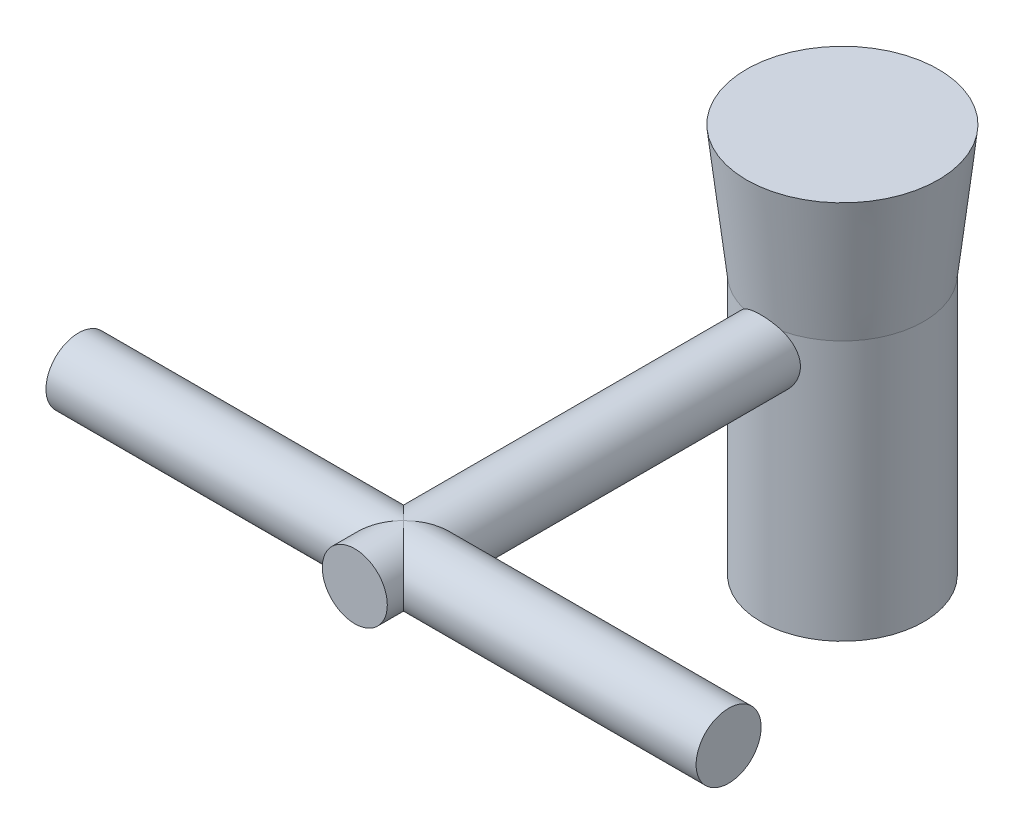
ISO-10303-21;
HEADER;
FILE_DESCRIPTION(('STEP AP214'),'2;1');
FILE_NAME('part.step','',(''),(''),'','','');
FILE_SCHEMA(('AUTOMOTIVE_DESIGN { 1 0 10303 214 1 1 1 1 }'));
ENDSEC;
DATA;
#1=APPLICATION_CONTEXT('core data for automotive mechanical design processes');
#2=APPLICATION_PROTOCOL_DEFINITION('international standard','automotive_design',2000,#1);
#3=PRODUCT_CONTEXT('',#1,'mechanical');
#4=PRODUCT('Part','Part','',(#3));
#5=PRODUCT_RELATED_PRODUCT_CATEGORY('part','',(#4));
#6=PRODUCT_DEFINITION_FORMATION('','',#4);
#7=PRODUCT_DEFINITION_CONTEXT('part definition',#1,'design');
#8=PRODUCT_DEFINITION('design','',#6,#7);
#9=PRODUCT_DEFINITION_SHAPE('','',#8);
#10=(LENGTH_UNIT() NAMED_UNIT(*) SI_UNIT(.MILLI.,.METRE.));
#11=(NAMED_UNIT(*) PLANE_ANGLE_UNIT() SI_UNIT($,.RADIAN.));
#12=(NAMED_UNIT(*) SI_UNIT($,.STERADIAN.) SOLID_ANGLE_UNIT());
#13=UNCERTAINTY_MEASURE_WITH_UNIT(LENGTH_MEASURE(1.E-05),#10,'distance_accuracy_value','');
#14=(GEOMETRIC_REPRESENTATION_CONTEXT(3) GLOBAL_UNCERTAINTY_ASSIGNED_CONTEXT((#13)) GLOBAL_UNIT_ASSIGNED_CONTEXT((#10,
#11,#12)) REPRESENTATION_CONTEXT('',''));
#15=CARTESIAN_POINT('',(0.,0.,0.));
#16=DIRECTION('',(0.,0.,1.));
#17=DIRECTION('',(1.,0.,0.));
#18=AXIS2_PLACEMENT_3D('',#15,#16,#17);
#19=CARTESIAN_POINT('',(0.,36.,75.));
#20=DIRECTION('',(0.,0.,-1.));
#21=DIRECTION('',(-1.,0.,0.));
#22=AXIS2_PLACEMENT_3D('',#19,#20,#21);
#23=CYLINDRICAL_SURFACE('',#22,5.);
#24=CARTESIAN_POINT('',(-3.00026664814979,39.9998,12.1345719965933));
#25=CARTESIAN_POINT('',(-2.89580643651016,40.0781653610829,12.1694893998559));
#26=CARTESIAN_POINT('',(-2.78800661177118,40.1526218248524,12.2032737451044));
#27=CARTESIAN_POINT('',(-2.5662273111925,40.2932161493024,12.2679855883498));
#28=CARTESIAN_POINT('',(-2.45224498056239,40.3593501194393,12.2989117484404));
#29=CARTESIAN_POINT('',(-2.21837128762021,40.4828975487615,12.3573646347931));
#30=CARTESIAN_POINT('',(-2.09846425913462,40.5402860470037,12.3848815903458));
#31=CARTESIAN_POINT('',(-1.85373613608164,40.6455787482831,12.4358436142902));
#32=CARTESIAN_POINT('',(-1.72891579073179,40.6934843906685,12.4592893005701));
#33=CARTESIAN_POINT('',(-1.47470276611154,40.7794680706628,12.5016731161841));
#34=CARTESIAN_POINT('',(-1.34529613028226,40.8175125393747,12.5205958320748));
#35=CARTESIAN_POINT('',(-1.08322674327714,40.8831202571427,12.5533934781929));
#36=CARTESIAN_POINT('',(-0.950564157354015,40.9106840369701,12.5672686640398));
#37=CARTESIAN_POINT('',(-0.683237023391345,40.9549479126456,12.5896175623152));
#38=CARTESIAN_POINT('',(-0.548576578908646,40.9716677780876,12.5981011037069));
#39=CARTESIAN_POINT('',(-0.278112085612271,40.9941029323143,12.6094960263114));
#40=CARTESIAN_POINT('',(-0.142308116170077,40.9998189786469,12.6124077911081));
#41=CARTESIAN_POINT('',(0.121204455735637,41.0001620219229,12.6125825346205));
#42=CARTESIAN_POINT('',(0.248912540093866,40.9954303984033,12.6101722334856));
#43=CARTESIAN_POINT('',(0.503446261115103,40.9762272489955,12.6004154399277));
#44=CARTESIAN_POINT('',(0.630271586578004,40.9617524482192,12.5930672877901));
#45=CARTESIAN_POINT('',(0.882161254928893,40.9232132522348,12.5735862011067));
#46=CARTESIAN_POINT('',(1.0072245521236,40.8991433920052,12.5614505397986));
#47=CARTESIAN_POINT('',(1.25467771048472,40.8416881008065,12.5326589287544));
#48=CARTESIAN_POINT('',(1.37706658644995,40.808299297295,12.5160013425854));
#49=CARTESIAN_POINT('',(1.73759605920766,40.6950879980784,12.4599546357968));
#50=CARTESIAN_POINT('',(1.97074026484053,40.6019642450076,12.4143580765837));
#51=CARTESIAN_POINT('',(2.41770788180568,40.3836644369952,12.3100828496034));
#52=CARTESIAN_POINT('',(2.6315622882673,40.2585410868575,12.2514257135623));
#53=CARTESIAN_POINT('',(2.89031338770112,40.0805371773616,12.1707102446378));
#54=CARTESIAN_POINT('',(2.94575378970255,40.0406948893745,12.1527925214656));
#55=CARTESIAN_POINT('',(3.0002666481498,39.9998,12.1345719965933));
#56=B_SPLINE_CURVE_WITH_KNOTS('',3,(#24,#25,#26,#27,#28,#29,#30,#31,#32,#33,#34,#35,#36,#37,#38,
#39,#40,#41,#42,#43,#44,#45,#46,#47,#48,#49,#50,#51,#52,#53,#54,#55),.UNSPECIFIED.,.F.,.F.,(4,2,
2,2,2,2,2,2,2,2,2,2,2,2,2,4),(0.,0.405456464118728,0.811101769729969,1.21788399869292,
1.62460443708782,2.03269174905937,2.44075839159699,2.84807897888413,3.25537152355422,
3.63835904374981,4.0214753584787,4.4048101958008,4.78828394297885,5.55029469510758,
6.31105837391752,6.52274180208851),.UNSPECIFIED.);
#57=CARTESIAN_POINT('',(-3.,40.,12.1346610995116));
#58=VERTEX_POINT('',#57);
#59=CARTESIAN_POINT('',(3.,40.,12.1346610995116));
#60=VERTEX_POINT('',#59);
#61=EDGE_CURVE('E71',#58,#60,#56,.T.);
#62=ORIENTED_EDGE('',*,*,#61,.F.);
#63=CARTESIAN_POINT('',(-5.,36.,11.4564392373896));
#64=CARTESIAN_POINT('',(-4.99999896345635,35.8660283447571,11.4564402717028));
#65=CARTESIAN_POINT('',(-4.99460812226168,35.7320157412703,11.458797133836));
#66=CARTESIAN_POINT('',(-4.97309727860774,35.4649593159264,11.468148782329));
#67=CARTESIAN_POINT('',(-4.9569707092876,35.3319161374354,11.475146407354));
#68=CARTESIAN_POINT('',(-4.91411809632374,35.0675821130226,11.4935628683181));
#69=CARTESIAN_POINT('',(-4.88737092988402,34.9362953014132,11.5049905138317));
#70=CARTESIAN_POINT('',(-4.82354498839359,34.6766328447658,11.5318953875125));
#71=CARTESIAN_POINT('',(-4.78646192376799,34.5482584323957,11.5473742968604));
#72=CARTESIAN_POINT('',(-4.70249631279829,34.2958467735072,11.581820925773));
#73=CARTESIAN_POINT('',(-4.65565574627603,34.1717935213556,11.6007736592095));
#74=CARTESIAN_POINT('',(-4.55248500137674,33.9281880184655,11.6416475565821));
#75=CARTESIAN_POINT('',(-4.49615125924048,33.8086374787531,11.6635698346833));
#76=CARTESIAN_POINT('',(-4.31360496151711,33.4579270960664,11.7328492963712));
#77=CARTESIAN_POINT('',(-4.17374176623427,33.2343936453876,11.7837645418909));
#78=CARTESIAN_POINT('',(-3.85329894815134,32.8018142111573,11.8925250245327));
#79=CARTESIAN_POINT('',(-3.67098388496263,32.5941207934567,11.9505927192206));
#80=CARTESIAN_POINT('',(-3.27423726141594,32.211165651799,12.0653166560418));
#81=CARTESIAN_POINT('',(-3.05979452486023,32.0359152613583,12.1219723989708));
#82=CARTESIAN_POINT('',(-2.7134344670967,31.7978552144935,12.202547497669));
#83=CARTESIAN_POINT('',(-2.59127330992831,31.7214339497963,12.2291337235759));
#84=CARTESIAN_POINT('',(-2.34040236484104,31.5792226804951,12.279611145716));
#85=CARTESIAN_POINT('',(-2.21169530438852,31.5134282949656,12.3035034512837));
#86=CARTESIAN_POINT('',(-1.94856757348532,31.3930458325952,12.3479105610271));
#87=CARTESIAN_POINT('',(-1.81414622685608,31.3384590864486,12.368424964084));
#88=CARTESIAN_POINT('',(-1.54063330241624,31.2410603355298,12.4054615764431));
#89=CARTESIAN_POINT('',(-1.40154404015105,31.1982425867934,12.421985732741));
#90=CARTESIAN_POINT('',(-1.12649748730777,31.1265801700171,12.4498668714047));
#91=CARTESIAN_POINT('',(-0.990710411787404,31.0971633612554,12.4614338373031));
#92=CARTESIAN_POINT('',(-0.716918272307664,31.0497150885416,12.4801780649836));
#93=CARTESIAN_POINT('',(-0.578914206131968,31.0316786422134,12.4873572477146));
#94=CARTESIAN_POINT('',(-0.301736395081981,31.0071741086334,12.4971270279997));
#95=CARTESIAN_POINT('',(-0.16256278505686,31.000704705593,12.4997181474605));
#96=CARTESIAN_POINT('',(0.115845101070371,30.9994044220967,12.5002382016647));
#97=CARTESIAN_POINT('',(0.255079374867633,31.004573132475,12.4981673003126));
#98=CARTESIAN_POINT('',(0.524650869352966,31.0258690983752,12.4896713712922));
#99=CARTESIAN_POINT('',(0.655046772976121,31.0413614909945,12.4834986467002));
#100=CARTESIAN_POINT('',(0.914018496973074,31.0825039320662,12.4672134509988));
#101=CARTESIAN_POINT('',(1.04259369775126,31.1081573562362,12.4570996706023));
#102=CARTESIAN_POINT('',(1.29697225214546,31.1693722183383,12.4331882180521));
#103=CARTESIAN_POINT('',(1.4227765024733,31.2049303985908,12.4193917571961));
#104=CARTESIAN_POINT('',(1.67086551320143,31.2856332827261,12.3884573859377));
#105=CARTESIAN_POINT('',(1.79314891686559,31.3307816274306,12.3713182067042));
#106=CARTESIAN_POINT('',(2.15709786014183,31.4815462448965,12.3149324325075));
#107=CARTESIAN_POINT('',(2.39225334748551,31.6016096016308,12.2710725946817));
#108=CARTESIAN_POINT('',(2.83956110178506,31.8761772077449,12.1753610452512));
#109=CARTESIAN_POINT('',(3.05170544744261,32.0306932614583,12.1235065963813));
#110=CARTESIAN_POINT('',(3.4619051893143,32.3816081565145,12.0130436045134));
#111=CARTESIAN_POINT('',(3.65812112197785,32.5800907527545,11.9542151441502));
#112=CARTESIAN_POINT('',(4.01529203734465,33.0075204226263,11.8390345406944));
#113=CARTESIAN_POINT('',(4.17623547858125,33.2364774284798,11.7826832129484));
#114=CARTESIAN_POINT('',(4.38978443246195,33.6019725905173,11.7040921301282));
#115=CARTESIAN_POINT('',(4.45706290689687,33.7294421756794,11.6785690992132));
#116=CARTESIAN_POINT('',(4.58054965734117,33.990188779216,11.6306899868532));
#117=CARTESIAN_POINT('',(4.63676242676806,34.1234634133913,11.6083326209757));
#118=CARTESIAN_POINT('',(4.73756451801146,34.3948711331214,11.5675599040095));
#119=CARTESIAN_POINT('',(4.78215750962756,34.5330026690723,11.5491433086618));
#120=CARTESIAN_POINT('',(4.8592612872628,34.813124013641,11.5169149498478));
#121=CARTESIAN_POINT('',(4.89177304591582,34.9551135106747,11.5031028156954));
#122=CARTESIAN_POINT('',(4.94271833591523,35.2330205622847,11.4813002098815));
#123=CARTESIAN_POINT('',(4.96189056112493,35.3687791615958,11.4730056443021));
#124=CARTESIAN_POINT('',(4.98902318531047,35.6416170735737,11.4612332927934));
#125=CARTESIAN_POINT('',(4.9969842489227,35.7786963074636,11.4577552213259));
#126=CARTESIAN_POINT('',(5.00160011831507,36.0530459962113,11.4557410341827));
#127=CARTESIAN_POINT('',(4.99825781264842,36.1903163932562,11.4572036559226));
#128=CARTESIAN_POINT('',(4.9803144219869,36.4639741829387,11.465014739381));
#129=CARTESIAN_POINT('',(4.96571362083305,36.6003615977501,11.4713630779243));
#130=CARTESIAN_POINT('',(4.9265749164465,36.8634312022493,11.4882237920049));
#131=CARTESIAN_POINT('',(4.90265366107081,36.9902220519028,11.4984770141227));
#132=CARTESIAN_POINT('',(4.8451953366982,37.2412438186926,11.5228053113983));
#133=CARTESIAN_POINT('',(4.81165515509087,37.3654738932115,11.5368816236004));
#134=CARTESIAN_POINT('',(4.69704010843111,37.7330822513964,11.5842454065119));
#135=CARTESIAN_POINT('',(4.60193998403524,37.9715824009332,11.6226817971661));
#136=CARTESIAN_POINT('',(4.37282827873935,38.4390467693336,11.7108466432683));
#137=CARTESIAN_POINT('',(4.23739510722872,38.6672320431577,11.7609698182513));
#138=CARTESIAN_POINT('',(3.93292512945836,39.0986908904228,11.8662574257747));
#139=CARTESIAN_POINT('',(3.76387463817205,39.3019542639372,11.9214239063997));
#140=CARTESIAN_POINT('',(3.38207030815393,39.6934608170582,12.0355301113653));
#141=CARTESIAN_POINT('',(3.16701066461657,39.8794855101171,12.0944475552276));
#142=CARTESIAN_POINT('',(2.82252119889671,40.1296007300178,12.1777434479098));
#143=CARTESIAN_POINT('',(2.70396535427572,40.2081897837919,12.2046763459874));
#144=CARTESIAN_POINT('',(2.46021851983988,40.3551743297635,12.2561332265696));
#145=CARTESIAN_POINT('',(2.33503041301596,40.4235742026212,12.2806582427457));
#146=CARTESIAN_POINT('',(2.07877500253335,40.549625993472,12.3266236420592));
#147=CARTESIAN_POINT('',(1.94770617679833,40.6072751087603,12.3480632204964));
#148=CARTESIAN_POINT('',(1.68067073132675,40.7112484341921,12.3872330385287));
#149=CARTESIAN_POINT('',(1.54470622361311,40.7575774622826,12.4049648557207));
#150=CARTESIAN_POINT('',(1.26887322258795,40.8384514406103,12.4362060252013));
#151=CARTESIAN_POINT('',(1.12900563371975,40.8729990967598,12.4497163470114));
#152=CARTESIAN_POINT('',(0.846455094767159,40.9299369384677,12.4721125367424));
#153=CARTESIAN_POINT('',(0.703772335695231,40.9523279459485,12.4809987173042));
#154=CARTESIAN_POINT('',(0.426189188874803,40.9836307849264,12.4934537211406));
#155=CARTESIAN_POINT('',(0.291390847308927,40.9933290978161,12.4973325728447));
#156=CARTESIAN_POINT('',(0.0213478994604268,41.0017794297219,12.5007112401544));
#157=CARTESIAN_POINT('',(-0.11389684183211,41.0005277609661,12.5002095804766));
#158=CARTESIAN_POINT('',(-0.383682371685978,40.9870853137872,12.494838227668));
#159=CARTESIAN_POINT('',(-0.518223488997529,40.9749002097683,12.4899708003515));
#160=CARTESIAN_POINT('',(-0.785710697483676,40.9397231134616,12.4760011543377));
#161=CARTESIAN_POINT('',(-0.918656174981789,40.9167270918159,12.4668973567075));
#162=CARTESIAN_POINT('',(-1.17783467109343,40.8610407550843,12.4450424209029));
#163=CARTESIAN_POINT('',(-1.30414775975407,40.8286748940186,12.4324137928292));
#164=CARTESIAN_POINT('',(-1.55352320958305,40.7543161133706,12.4037235206992));
#165=CARTESIAN_POINT('',(-1.6765844138923,40.7123198178389,12.3876606729109));
#166=CARTESIAN_POINT('',(-2.03966746176944,40.5724070907497,12.3348836832436));
#167=CARTESIAN_POINT('',(-2.27380285420271,40.4605203244963,12.2935620878725));
#168=CARTESIAN_POINT('',(-2.73054850188528,40.1972279703313,12.2004490642966));
#169=CARTESIAN_POINT('',(-2.95219224097234,40.0442945231078,12.1482756628413));
#170=CARTESIAN_POINT('',(-3.36761879060514,39.7055434478447,12.0397376610957));
#171=CARTESIAN_POINT('',(-3.56139000921306,39.5197122091607,11.9833713317038));
#172=CARTESIAN_POINT('',(-3.92802886630617,39.1066642056903,11.868436623319));
#173=CARTESIAN_POINT('',(-4.09885985592737,38.8775976026115,11.8099479390711));
#174=CARTESIAN_POINT('',(-4.324448364638,38.5138807539211,11.728408450531));
#175=CARTESIAN_POINT('',(-4.39457064715658,38.3892009253691,11.702245811434));
#176=CARTESIAN_POINT('',(-4.52406061529862,38.1338529587129,11.652796822025));
#177=CARTESIAN_POINT('',(-4.58343354679448,38.0031877807881,11.6295090704921));
#178=CARTESIAN_POINT('',(-4.68607952471921,37.7486504961309,11.5885044900563));
#179=CARTESIAN_POINT('',(-4.73031761912949,37.6252161622396,11.5704756811238));
#180=CARTESIAN_POINT('',(-4.80904723188734,37.3748702113205,11.5379755486851));
#181=CARTESIAN_POINT('',(-4.84354316940793,37.2479601996582,11.523502612576));
#182=CARTESIAN_POINT('',(-4.90241942653943,36.9917302139116,11.4985783767202));
#183=CARTESIAN_POINT('',(-4.92682213915176,36.8624162471613,11.4881181780282));
#184=CARTESIAN_POINT('',(-4.96536414411407,36.6020463003409,11.4715127104981));
#185=CARTESIAN_POINT('',(-4.97950939371721,36.4709913764836,11.4653649371894));
#186=CARTESIAN_POINT('',(-4.99230265232103,36.2830623031111,11.4597961056739));
#187=CARTESIAN_POINT('',(-4.99518816672681,36.2265003704817,11.4585382897539));
#188=CARTESIAN_POINT('',(-4.9990371301843,36.1132947363357,11.4568596062454));
#189=CARTESIAN_POINT('',(-5.00000043831111,36.0566510291284,11.4564388000217));
#190=CARTESIAN_POINT('',(-5.,36.,11.4564392373896));
#191=B_SPLINE_CURVE_WITH_KNOTS('',3,(#63,#64,#65,#66,#67,#68,#69,#70,#71,#72,#73,#74,#75,#76,
#77,#78,#79,#80,#81,#82,#83,#84,#85,#86,#87,#88,#89,#90,#91,#92,#93,#94,#95,#96,#97,#98,#99,
#100,#101,#102,#103,#104,#105,#106,#107,#108,#109,#110,#111,#112,#113,#114,#115,#116,#117,#118,
#119,#120,#121,#122,#123,#124,#125,#126,#127,#128,#129,#130,#131,#132,#133,#134,#135,#136,#137,
#138,#139,#140,#141,#142,#143,#144,#145,#146,#147,#148,#149,#150,#151,#152,#153,#154,#155,#156,
#157,#158,#159,#160,#161,#162,#163,#164,#165,#166,#167,#168,#169,#170,#171,#172,#173,#174,#175,
#176,#177,#178,#179,#180,#181,#182,#183,#184,#185,#186,#187,#188,#189,#190),.UNSPECIFIED.,.T.,
.F.,(4,2,2,2,2,2,2,2,2,2,2,2,2,2,2,2,2,2,2,2,2,2,2,2,2,2,2,2,2,2,2,2,2,2,2,2,2,2,2,2,2,2,2,2,2,
2,2,2,2,2,2,2,2,2,2,2,2,2,2,2,2,2,2,4),(0.,0.401857604172999,0.803961243888986,1.20686864636057,
1.60994351192957,2.01131877198553,2.41284504624412,3.21490370860718,4.05855844512126,
4.90250734671921,5.34162944437914,5.78057004956792,6.21956274051595,6.65834079517783,
7.07605372410075,7.49358364921535,7.91106607592916,8.3285338252766,8.7224433905093,
9.11648393105507,9.51039502417149,9.90445593031429,10.7036345579603,11.5030874255886,
12.3550281541217,13.207247230266,13.6459081564649,14.0843905878331,14.5227343678116,
14.9610428500329,15.3725755678593,15.7840838875773,16.1954870551217,16.6068798510072,
16.9947241755283,17.3826941453684,18.1580219095308,18.9647918095574,19.7718908063861,
20.6386062994143,21.0724736227438,21.5061538706741,21.9399470207648,22.3735552211117,
22.8070637643667,23.2405429940499,23.6456433748876,24.050880192055,24.4559068146868,
24.8610845153934,25.2536349873096,25.646323278747,26.4310478633778,27.2504496961613,
28.0701913317683,28.9406797498035,29.3764938523358,29.8120946932276,30.2087331024766,
30.6051913011724,31.0007651307087,31.3961090374152,31.5660254121741,31.735954243748),.UNSPECIFIED.);
#192=EDGE_CURVE('E74',#58,#60,#191,.T.);
#193=ORIENTED_EDGE('',*,*,#192,.T.);
#194=EDGE_LOOP('',(#62,#193));
#195=FACE_BOUND('',#194,.T.);
#196=CARTESIAN_POINT('',(0.,36.,67.5));
#197=DIRECTION('',(-0.707106781186547,0.,-0.707106781186547));
#198=DIRECTION('',(0.707106781186547,0.,-0.707106781186547));
#199=AXIS2_PLACEMENT_3D('',#196,#197,#198);
#200=ELLIPSE('',#199,7.07106781186548,5.);
#201=CARTESIAN_POINT('',(0.,31.,67.5));
#202=VERTEX_POINT('',#201);
#203=CARTESIAN_POINT('',(0.,41.,67.5));
#204=VERTEX_POINT('',#203);
#205=EDGE_CURVE('E12',#202,#204,#200,.F.);
#206=ORIENTED_EDGE('',*,*,#205,.F.);
#207=CARTESIAN_POINT('',(0.,36.,67.5));
#208=DIRECTION('',(0.707106781186547,0.,-0.707106781186547));
#209=DIRECTION('',(-0.707106781186547,0.,-0.707106781186547));
#210=AXIS2_PLACEMENT_3D('',#207,#208,#209);
#211=ELLIPSE('',#210,7.07106781186548,5.);
#212=EDGE_CURVE('E56',#204,#202,#211,.F.);
#213=ORIENTED_EDGE('',*,*,#212,.F.);
#214=EDGE_LOOP('',(#206,#213));
#215=FACE_BOUND('',#214,.T.);
#216=ADVANCED_FACE('F41',(#195,#215),#23,.T.);
#217=CARTESIAN_POINT('',(0.,40.,0.));
#218=DIRECTION('',(0.,-1.,0.));
#219=DIRECTION('',(0.,0.,-1.));
#220=AXIS2_PLACEMENT_3D('',#217,#218,#219);
#221=CYLINDRICAL_SURFACE('',#220,12.5);
#222=CARTESIAN_POINT('',(0.,0.,0.));
#223=DIRECTION('',(0.,1.,0.));
#224=DIRECTION('',(0.,0.,1.));
#225=AXIS2_PLACEMENT_3D('',#222,#223,#224);
#226=CIRCLE('',#225,12.5);
#227=CARTESIAN_POINT('',(0.,0.,12.5));
#228=VERTEX_POINT('',#227);
#229=EDGE_CURVE('E85',#228,#228,#226,.T.);
#230=ORIENTED_EDGE('',*,*,#229,.T.);
#231=EDGE_LOOP('',(#230));
#232=FACE_BOUND('',#231,.T.);
#233=ORIENTED_EDGE('',*,*,#192,.F.);
#234=CARTESIAN_POINT('',(0.,40.,0.));
#235=DIRECTION('',(0.,1.,0.));
#236=DIRECTION('',(0.,0.,1.));
#237=AXIS2_PLACEMENT_3D('',#234,#235,#236);
#238=CIRCLE('',#237,12.5);
#239=EDGE_CURVE('E78',#60,#58,#238,.T.);
#240=ORIENTED_EDGE('',*,*,#239,.F.);
#241=EDGE_LOOP('',(#233,#240));
#242=FACE_BOUND('',#241,.T.);
#243=ADVANCED_FACE('F43',(#232,#242),#221,.T.);
#244=CARTESIAN_POINT('',(0.,40.,0.));
#245=DIRECTION('',(0.,1.,0.));
#246=DIRECTION('',(0.,0.,1.));
#247=AXIS2_PLACEMENT_3D('',#244,#245,#246);
#248=CONICAL_SURFACE('',#247,12.5,0.112028962425988);
#249=CARTESIAN_POINT('',(0.,60.,0.));
#250=DIRECTION('',(0.,1.,0.));
#251=DIRECTION('',(0.,0.,1.));
#252=AXIS2_PLACEMENT_3D('',#249,#250,#251);
#253=CIRCLE('',#252,14.75);
#254=CARTESIAN_POINT('',(0.,60.,14.75));
#255=VERTEX_POINT('',#254);
#256=EDGE_CURVE('E81',#255,#255,#253,.T.);
#257=ORIENTED_EDGE('',*,*,#256,.F.);
#258=EDGE_LOOP('',(#257));
#259=FACE_BOUND('',#258,.T.);
#260=ORIENTED_EDGE('',*,*,#239,.T.);
#261=ORIENTED_EDGE('',*,*,#61,.T.);
#262=EDGE_LOOP('',(#260,#261));
#263=FACE_BOUND('',#262,.T.);
#264=ADVANCED_FACE('F84',(#259,#263),#248,.T.);
#265=CARTESIAN_POINT('',(0.,0.,0.));
#266=DIRECTION('',(0.,1.,0.));
#267=DIRECTION('',(0.,0.,1.));
#268=AXIS2_PLACEMENT_3D('',#265,#266,#267);
#269=PLANE('',#268);
#270=ORIENTED_EDGE('',*,*,#229,.F.);
#271=EDGE_LOOP('',(#270));
#272=FACE_BOUND('',#271,.T.);
#273=ADVANCED_FACE('F142',(#272),#269,.F.);
#274=CARTESIAN_POINT('',(0.,60.,0.));
#275=DIRECTION('',(0.,1.,0.));
#276=DIRECTION('',(0.,0.,1.));
#277=AXIS2_PLACEMENT_3D('',#274,#275,#276);
#278=PLANE('',#277);
#279=ORIENTED_EDGE('',*,*,#256,.T.);
#280=EDGE_LOOP('',(#279));
#281=FACE_BOUND('',#280,.T.);
#282=ADVANCED_FACE('F108',(#281),#278,.T.);
#283=CARTESIAN_POINT('',(-50.,36.,67.5));
#284=DIRECTION('',(1.,0.,0.));
#285=DIRECTION('',(0.,0.,-1.));
#286=AXIS2_PLACEMENT_3D('',#283,#284,#285);
#287=PLANE('',#286);
#288=CARTESIAN_POINT('',(-50.,36.,67.5));
#289=DIRECTION('',(1.,0.,0.));
#290=DIRECTION('',(0.,0.,-1.));
#291=AXIS2_PLACEMENT_3D('',#288,#289,#290);
#292=CIRCLE('',#291,5.00000000000001);
#293=CARTESIAN_POINT('',(-50.,36.,62.5));
#294=VERTEX_POINT('',#293);
#295=EDGE_CURVE('E256',#294,#294,#292,.T.);
#296=ORIENTED_EDGE('',*,*,#295,.F.);
#297=EDGE_LOOP('',(#296));
#298=FACE_BOUND('',#297,.T.);
#299=ADVANCED_FACE('F141',(#298),#287,.F.);
#300=CARTESIAN_POINT('',(50.,36.,67.5));
#301=DIRECTION('',(-1.,0.,0.));
#302=DIRECTION('',(0.,0.,1.));
#303=AXIS2_PLACEMENT_3D('',#300,#301,#302);
#304=CYLINDRICAL_SURFACE('',#303,5.00000000000001);
#305=ORIENTED_EDGE('',*,*,#295,.T.);
#306=EDGE_LOOP('',(#305));
#307=FACE_BOUND('',#306,.T.);
#308=ORIENTED_EDGE('',*,*,#212,.T.);
#309=CARTESIAN_POINT('',(0.,36.,67.5));
#310=DIRECTION('',(-0.707106781186547,0.,-0.707106781186547));
#311=DIRECTION('',(0.707106781186547,0.,-0.707106781186547));
#312=AXIS2_PLACEMENT_3D('',#309,#310,#311);
#313=ELLIPSE('',#312,7.07106781186548,5.);
#314=EDGE_CURVE('E50',#202,#204,#313,.T.);
#315=ORIENTED_EDGE('',*,*,#314,.T.);
#316=EDGE_LOOP('',(#308,#315));
#317=FACE_BOUND('',#316,.T.);
#318=ADVANCED_FACE('F147',(#307,#317),#304,.T.);
#319=CARTESIAN_POINT('',(50.,36.,67.5));
#320=DIRECTION('',(1.,0.,0.));
#321=DIRECTION('',(0.,0.,-1.));
#322=AXIS2_PLACEMENT_3D('',#319,#320,#321);
#323=CIRCLE('',#322,5.00000000000001);
#324=CARTESIAN_POINT('',(50.,36.,62.5));
#325=VERTEX_POINT('',#324);
#326=EDGE_CURVE('E254',#325,#325,#323,.T.);
#327=ORIENTED_EDGE('',*,*,#326,.F.);
#328=EDGE_LOOP('',(#327));
#329=FACE_BOUND('',#328,.T.);
#330=CARTESIAN_POINT('',(0.,36.,67.5));
#331=DIRECTION('',(0.707106781186547,0.,-0.707106781186547));
#332=DIRECTION('',(-0.707106781186547,0.,-0.707106781186547));
#333=AXIS2_PLACEMENT_3D('',#330,#331,#332);
#334=ELLIPSE('',#333,7.07106781186548,5.);
#335=EDGE_CURVE('E63',#204,#202,#334,.T.);
#336=ORIENTED_EDGE('',*,*,#335,.T.);
#337=ORIENTED_EDGE('',*,*,#205,.T.);
#338=EDGE_LOOP('',(#336,#337));
#339=FACE_BOUND('',#338,.T.);
#340=ADVANCED_FACE('F202',(#329,#339),#304,.T.);
#341=CARTESIAN_POINT('',(50.,36.,67.5));
#342=DIRECTION('',(1.,0.,0.));
#343=DIRECTION('',(0.,0.,-1.));
#344=AXIS2_PLACEMENT_3D('',#341,#342,#343);
#345=PLANE('',#344);
#346=ORIENTED_EDGE('',*,*,#326,.T.);
#347=EDGE_LOOP('',(#346));
#348=FACE_BOUND('',#347,.T.);
#349=ADVANCED_FACE('F175',(#348),#345,.T.);
#350=CARTESIAN_POINT('',(0.,36.,75.));
#351=DIRECTION('',(0.,0.,1.));
#352=DIRECTION('',(1.,0.,0.));
#353=AXIS2_PLACEMENT_3D('',#350,#351,#352);
#354=PLANE('',#353);
#355=CARTESIAN_POINT('',(0.,36.,75.));
#356=DIRECTION('',(0.,0.,1.));
#357=DIRECTION('',(1.,0.,0.));
#358=AXIS2_PLACEMENT_3D('',#355,#356,#357);
#359=CIRCLE('',#358,5.);
#360=CARTESIAN_POINT('',(5.,36.,75.));
#361=VERTEX_POINT('',#360);
#362=EDGE_CURVE('E82',#361,#361,#359,.T.);
#363=ORIENTED_EDGE('',*,*,#362,.T.);
#364=EDGE_LOOP('',(#363));
#365=FACE_BOUND('',#364,.T.);
#366=ADVANCED_FACE('F106',(#365),#354,.T.);
#367=ORIENTED_EDGE('',*,*,#362,.F.);
#368=EDGE_LOOP('',(#367));
#369=FACE_BOUND('',#368,.T.);
#370=ORIENTED_EDGE('',*,*,#314,.F.);
#371=ORIENTED_EDGE('',*,*,#335,.F.);
#372=EDGE_LOOP('',(#370,#371));
#373=FACE_BOUND('',#372,.T.);
#374=ADVANCED_FACE('F105',(#369,#373),#23,.T.);
#375=CLOSED_SHELL('',(#216,#243,#264,#273,#282,#299,#318,#340,#349,#366,#374));
#376=MANIFOLD_SOLID_BREP('B2',#375);
#377=ADVANCED_BREP_SHAPE_REPRESENTATION('',(#18,#376),#14);
#378=SHAPE_DEFINITION_REPRESENTATION(#9,#377);
ENDSEC;
END-ISO-10303-21;
